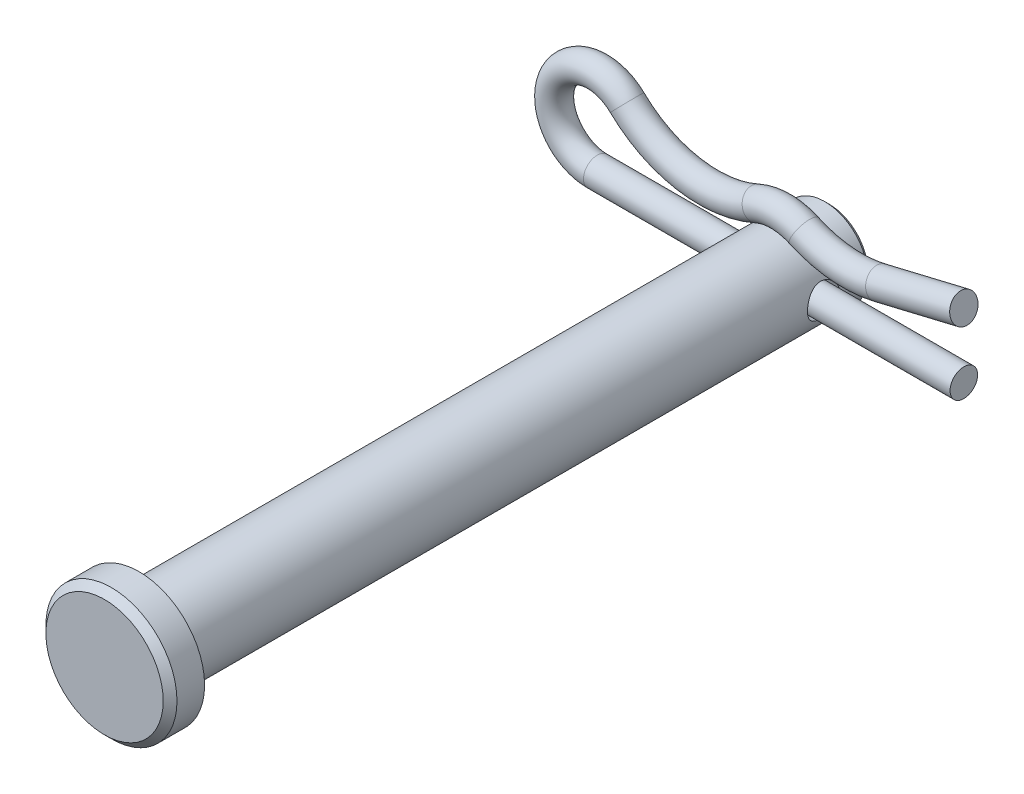
ISO-10303-21;
HEADER;
FILE_DESCRIPTION(('STEP AP214'),'2;1');
FILE_NAME('part.step','',(''),(''),'','','');
FILE_SCHEMA(('AUTOMOTIVE_DESIGN { 1 0 10303 214 1 1 1 1 }'));
ENDSEC;
DATA;
#1=APPLICATION_CONTEXT('core data for automotive mechanical design processes');
#2=APPLICATION_PROTOCOL_DEFINITION('international standard','automotive_design',2000,#1);
#3=PRODUCT_CONTEXT('',#1,'mechanical');
#4=PRODUCT('Part','Part','',(#3));
#5=PRODUCT_RELATED_PRODUCT_CATEGORY('part','',(#4));
#6=PRODUCT_DEFINITION_FORMATION('','',#4);
#7=PRODUCT_DEFINITION_CONTEXT('part definition',#1,'design');
#8=PRODUCT_DEFINITION('design','',#6,#7);
#9=PRODUCT_DEFINITION_SHAPE('','',#8);
#10=(LENGTH_UNIT() NAMED_UNIT(*) SI_UNIT(.MILLI.,.METRE.));
#11=(NAMED_UNIT(*) PLANE_ANGLE_UNIT() SI_UNIT($,.RADIAN.));
#12=(NAMED_UNIT(*) SI_UNIT($,.STERADIAN.) SOLID_ANGLE_UNIT());
#13=UNCERTAINTY_MEASURE_WITH_UNIT(LENGTH_MEASURE(1.E-05),#10,'distance_accuracy_value','');
#14=(GEOMETRIC_REPRESENTATION_CONTEXT(3) GLOBAL_UNCERTAINTY_ASSIGNED_CONTEXT((#13)) GLOBAL_UNIT_ASSIGNED_CONTEXT((#10,
#11,#12)) REPRESENTATION_CONTEXT('',''));
#15=CARTESIAN_POINT('',(0.,0.,0.));
#16=DIRECTION('',(0.,0.,1.));
#17=DIRECTION('',(1.,0.,0.));
#18=AXIS2_PLACEMENT_3D('',#15,#16,#17);
#19=CARTESIAN_POINT('',(7.30602677817418,3.28466385983467,-21.828125));
#20=DIRECTION('',(0.972644161927348,0.232300095283337,0.));
#21=DIRECTION('',(-0.232300095283337,0.972644161927348,0.));
#22=AXIS2_PLACEMENT_3D('',#19,#20,#21);
#23=CYLINDRICAL_SURFACE('',#22,1.016);
#24=CARTESIAN_POINT('',(7.30602677817418,3.28466385983467,-21.828125));
#25=DIRECTION('',(0.972644161927351,0.232300095283325,0.));
#26=DIRECTION('',(-0.232300095283325,0.972644161927351,0.));
#27=AXIS2_PLACEMENT_3D('',#24,#25,#26);
#28=CIRCLE('',#27,1.016);
#29=CARTESIAN_POINT('',(7.54204367498205,2.29645739131648,-21.828125));
#30=VERTEX_POINT('',#29);
#31=EDGE_CURVE('E46',#30,#30,#28,.T.);
#32=ORIENTED_EDGE('',*,*,#31,.T.);
#33=EDGE_LOOP('',(#32));
#34=FACE_BOUND('',#33,.T.);
#35=CARTESIAN_POINT('',(13.49375,4.76250000000001,-21.828125));
#36=DIRECTION('',(0.972644161927351,0.232300095283325,0.));
#37=DIRECTION('',(-0.232300095283325,0.972644161927351,0.));
#38=AXIS2_PLACEMENT_3D('',#35,#36,#37);
#39=CIRCLE('',#38,1.016);
#40=CARTESIAN_POINT('',(13.2577331031922,5.7507064685182,-21.828125));
#41=VERTEX_POINT('',#40);
#42=EDGE_CURVE('E11',#41,#41,#39,.T.);
#43=ORIENTED_EDGE('',*,*,#42,.F.);
#44=EDGE_LOOP('',(#43));
#45=FACE_BOUND('',#44,.T.);
#46=ADVANCED_FACE('F40',(#34,#45),#23,.T.);
#47=CARTESIAN_POINT('',(5.29632643400247,11.6993108904257,-21.828125));
#48=DIRECTION('',(0.,0.,1.));
#49=DIRECTION('',(1.,0.,0.));
#50=AXIS2_PLACEMENT_3D('',#47,#48,#49);
#51=TOROIDAL_SURFACE('',#50,8.65131089042575,1.016);
#52=CARTESIAN_POINT('',(1.72841977384718,3.8179897963947,-21.828125));
#53=DIRECTION('',(0.910997326746529,-0.412412258135811,0.));
#54=DIRECTION('',(0.412412258135811,0.910997326746529,0.));
#55=AXIS2_PLACEMENT_3D('',#52,#53,#54);
#56=CIRCLE('',#55,1.016);
#57=CARTESIAN_POINT('',(1.30940891958121,2.89241651242022,-21.828125));
#58=VERTEX_POINT('',#57);
#59=EDGE_CURVE('E50',#58,#58,#56,.T.);
#60=CARTESIAN_POINT('',(5.29632643400247,11.6993108904257,-21.828125));
#61=DIRECTION('',(0.,0.,1.));
#62=DIRECTION('',(1.,0.,0.));
#63=AXIS2_PLACEMENT_3D('',#60,#61,#62);
#64=CIRCLE('',#63,9.66731089042575);
#65=EDGE_CURVE('',#58,#30,#64,.T.);
#66=ORIENTED_EDGE('',*,*,#59,.T.);
#67=ORIENTED_EDGE('',*,*,#31,.F.);
#68=ORIENTED_EDGE('',*,*,#65,.T.);
#69=ORIENTED_EDGE('',*,*,#65,.F.);
#70=EDGE_LOOP('',(#66,#68,#67,#69));
#71=FACE_BOUND('',#70,.T.);
#72=ADVANCED_FACE('F87',(#71),#51,.T.);
#73=CARTESIAN_POINT('',(0.,0.,-21.828125));
#74=DIRECTION('',(0.,0.,-1.));
#75=DIRECTION('',(-1.,0.,0.));
#76=AXIS2_PLACEMENT_3D('',#73,#74,#75);
#77=TOROIDAL_SURFACE('',#76,4.191,1.016);
#78=CARTESIAN_POINT('',(-1.7284197738471,3.81798979639474,-21.828125));
#79=DIRECTION('',(0.910997326746538,0.412412258135789,0.));
#80=DIRECTION('',(-0.412412258135789,0.910997326746538,0.));
#81=AXIS2_PLACEMENT_3D('',#78,#79,#80);
#82=CIRCLE('',#81,1.016);
#83=CARTESIAN_POINT('',(-1.30940891958111,2.89241651242026,-21.828125));
#84=VERTEX_POINT('',#83);
#85=EDGE_CURVE('E54',#84,#84,#82,.T.);
#86=ORIENTED_EDGE('',*,*,#85,.T.);
#87=EDGE_LOOP('',(#86));
#88=FACE_BOUND('',#87,.T.);
#89=ORIENTED_EDGE('',*,*,#59,.F.);
#90=EDGE_LOOP('',(#89));
#91=FACE_BOUND('',#90,.T.);
#92=ADVANCED_FACE('F91',(#88,#91),#77,.T.);
#93=CARTESIAN_POINT('',(-5.29632643400247,11.6993108904257,-21.828125));
#94=DIRECTION('',(0.,0.,1.));
#95=DIRECTION('',(1.,0.,0.));
#96=AXIS2_PLACEMENT_3D('',#93,#94,#95);
#97=TOROIDAL_SURFACE('',#96,8.65131089042574,1.016);
#98=CARTESIAN_POINT('',(-11.2929944082361,5.46351476405987,-21.828125));
#99=DIRECTION('',(0.720792051672401,-0.693151367484686,0.));
#100=DIRECTION('',(0.693151367484686,0.720792051672401,0.));
#101=AXIS2_PLACEMENT_3D('',#98,#99,#100);
#102=CIRCLE('',#101,1.016);
#103=CARTESIAN_POINT('',(-11.9972361976005,4.7311900395607,-21.828125));
#104=VERTEX_POINT('',#103);
#105=EDGE_CURVE('E59',#104,#104,#102,.T.);
#106=CARTESIAN_POINT('',(-5.29632643400247,11.6993108904257,-21.828125));
#107=DIRECTION('',(0.,0.,1.));
#108=DIRECTION('',(1.,0.,0.));
#109=AXIS2_PLACEMENT_3D('',#106,#107,#108);
#110=CIRCLE('',#109,9.66731089042575);
#111=EDGE_CURVE('',#104,#84,#110,.T.);
#112=ORIENTED_EDGE('',*,*,#105,.T.);
#113=ORIENTED_EDGE('',*,*,#85,.F.);
#114=ORIENTED_EDGE('',*,*,#111,.T.);
#115=ORIENTED_EDGE('',*,*,#111,.F.);
#116=EDGE_LOOP('',(#112,#114,#113,#115));
#117=FACE_BOUND('',#116,.T.);
#118=ADVANCED_FACE('F97',(#117),#97,.T.);
#119=CARTESIAN_POINT('',(-13.49375,3.175,-21.828125));
#120=DIRECTION('',(0.,0.,-1.));
#121=DIRECTION('',(-1.,0.,0.));
#122=AXIS2_PLACEMENT_3D('',#119,#120,#121);
#123=TOROIDAL_SURFACE('',#122,3.175,1.016);
#124=CARTESIAN_POINT('',(-13.49375,0.,-21.828125));
#125=DIRECTION('',(-1.,0.,0.));
#126=DIRECTION('',(0.,-1.,0.));
#127=AXIS2_PLACEMENT_3D('',#124,#125,#126);
#128=CIRCLE('',#127,1.016);
#129=CARTESIAN_POINT('',(-13.49375,-1.016,-21.828125));
#130=VERTEX_POINT('',#129);
#131=EDGE_CURVE('E62',#130,#130,#128,.T.);
#132=ORIENTED_EDGE('',*,*,#131,.T.);
#133=EDGE_LOOP('',(#132));
#134=FACE_BOUND('',#133,.T.);
#135=ORIENTED_EDGE('',*,*,#105,.F.);
#136=EDGE_LOOP('',(#135));
#137=FACE_BOUND('',#136,.T.);
#138=ADVANCED_FACE('F69',(#134,#137),#123,.T.);
#139=CARTESIAN_POINT('',(-13.49375,0.,-21.828125));
#140=DIRECTION('',(1.,0.,0.));
#141=DIRECTION('',(0.,0.,-1.));
#142=AXIS2_PLACEMENT_3D('',#139,#140,#141);
#143=CYLINDRICAL_SURFACE('',#142,1.016);
#144=ORIENTED_EDGE('',*,*,#131,.F.);
#145=EDGE_LOOP('',(#144));
#146=FACE_BOUND('',#145,.T.);
#147=CARTESIAN_POINT('',(13.49375,0.,-21.828125));
#148=DIRECTION('',(-1.,0.,0.));
#149=DIRECTION('',(0.,-1.,0.));
#150=AXIS2_PLACEMENT_3D('',#147,#148,#149);
#151=CIRCLE('',#150,1.016);
#152=CARTESIAN_POINT('',(13.49375,-1.016,-21.828125));
#153=VERTEX_POINT('',#152);
#154=EDGE_CURVE('E63',#153,#153,#151,.T.);
#155=ORIENTED_EDGE('',*,*,#154,.T.);
#156=EDGE_LOOP('',(#155));
#157=FACE_BOUND('',#156,.T.);
#158=ADVANCED_FACE('F72',(#146,#157),#143,.T.);
#159=CARTESIAN_POINT('',(13.49375,4.76250000000001,-21.828125));
#160=DIRECTION('',(0.972644161927351,0.232300095283325,0.));
#161=DIRECTION('',(-0.232300095283325,0.972644161927351,0.));
#162=AXIS2_PLACEMENT_3D('',#159,#160,#161);
#163=PLANE('',#162);
#164=ORIENTED_EDGE('',*,*,#42,.T.);
#165=EDGE_LOOP('',(#164));
#166=FACE_BOUND('',#165,.T.);
#167=ADVANCED_FACE('F75',(#166),#163,.T.);
#168=CARTESIAN_POINT('',(13.49375,0.,-21.828125));
#169=DIRECTION('',(-1.,0.,0.));
#170=DIRECTION('',(0.,-1.,0.));
#171=AXIS2_PLACEMENT_3D('',#168,#169,#170);
#172=PLANE('',#171);
#173=ORIENTED_EDGE('',*,*,#154,.F.);
#174=EDGE_LOOP('',(#173));
#175=FACE_BOUND('',#174,.T.);
#176=ADVANCED_FACE('F79',(#175),#172,.F.);
#177=CLOSED_SHELL('',(#46,#72,#92,#118,#138,#158,#167,#176));
#178=MANIFOLD_SOLID_BREP('B2',#177);
#179=CARTESIAN_POINT('',(0.,0.,25.4));
#180=DIRECTION('',(0.,0.,-1.));
#181=DIRECTION('',(-1.,0.,0.));
#182=AXIS2_PLACEMENT_3D('',#179,#180,#181);
#183=CYLINDRICAL_SURFACE('',#182,3.175);
#184=CARTESIAN_POINT('',(0.,0.,-25.0825));
#185=DIRECTION('',(0.,0.,1.));
#186=DIRECTION('',(1.,0.,0.));
#187=AXIS2_PLACEMENT_3D('',#184,#185,#186);
#188=CIRCLE('',#187,3.175);
#189=CARTESIAN_POINT('',(3.175,0.,-25.0825));
#190=VERTEX_POINT('',#189);
#191=EDGE_CURVE('E163',#190,#190,#188,.T.);
#192=ORIENTED_EDGE('',*,*,#191,.T.);
#193=EDGE_LOOP('',(#192));
#194=FACE_BOUND('',#193,.T.);
#195=CARTESIAN_POINT('',(-3.175,0.,-20.6375));
#196=CARTESIAN_POINT('',(-3.1750017260582,-0.0644803280319206,-20.6374976962969));
#197=CARTESIAN_POINT('',(-3.17301863556027,-0.128944879414297,-20.6427544346972));
#198=CARTESIAN_POINT('',(-3.16530589955499,-0.255947427804686,-20.6635573799955));
#199=CARTESIAN_POINT('',(-3.15957679372107,-0.31848570096517,-20.6791021047485));
#200=CARTESIAN_POINT('',(-3.14498698210789,-0.43978574808651,-20.7198539451563));
#201=CARTESIAN_POINT('',(-3.13613231952368,-0.498554552928808,-20.7450424227273));
#202=CARTESIAN_POINT('',(-3.11617334413749,-0.611028202439702,-20.8042719653313));
#203=CARTESIAN_POINT('',(-3.10506842811866,-0.664731683597442,-20.8383154047757));
#204=CARTESIAN_POINT('',(-3.08122833533403,-0.767831218530124,-20.9157986965375));
#205=CARTESIAN_POINT('',(-3.06844702050705,-0.816983642057508,-20.9595483956684));
#206=CARTESIAN_POINT('',(-3.04292175316616,-0.907450095452757,-21.0545445325105));
#207=CARTESIAN_POINT('',(-3.03017781325932,-0.94876172610117,-21.1057932563948));
#208=CARTESIAN_POINT('',(-3.00563336052824,-1.02392323008938,-21.2167132398466));
#209=CARTESIAN_POINT('',(-2.99388727501525,-1.05742893349134,-21.2766309659458));
#210=CARTESIAN_POINT('',(-2.97338639063463,-1.11377925527679,-21.4017608811213));
#211=CARTESIAN_POINT('',(-2.96463039737106,-1.13662813187984,-21.4669709432544));
#212=CARTESIAN_POINT('',(-2.95159440179158,-1.1700544212018,-21.5980301625799));
#213=CARTESIAN_POINT('',(-2.94714552453477,-1.1810967711723,-21.6637433742581));
#214=CARTESIAN_POINT('',(-2.94273336284839,-1.19205022996995,-21.7962290754076));
#215=CARTESIAN_POINT('',(-2.94276822592073,-1.19196593587088,-21.8630011160129));
#216=CARTESIAN_POINT('',(-2.94717399857943,-1.18102403502952,-21.9914545606378));
#217=CARTESIAN_POINT('',(-2.95128528416453,-1.17081148004021,-22.0532014691726));
#218=CARTESIAN_POINT('',(-2.96294919584751,-1.14096933245487,-22.1740310506342));
#219=CARTESIAN_POINT('',(-2.97050234018473,-1.12133832170211,-22.2331133208748));
#220=CARTESIAN_POINT('',(-2.98835526113513,-1.07286225428949,-22.3482511725093));
#221=CARTESIAN_POINT('',(-2.99870429903107,-1.04384989935074,-22.4042283421088));
#222=CARTESIAN_POINT('',(-3.02096654298085,-0.977551335491413,-22.5107069292128));
#223=CARTESIAN_POINT('',(-3.03288028850369,-0.940262269910617,-22.5612064471563));
#224=CARTESIAN_POINT('',(-3.05790630844421,-0.855517884834481,-22.6588666580229));
#225=CARTESIAN_POINT('',(-3.07104532042939,-0.807547746065835,-22.7055748585938));
#226=CARTESIAN_POINT('',(-3.09635309230243,-0.704304368962598,-22.7904182606759));
#227=CARTESIAN_POINT('',(-3.10852170288599,-0.649030010276033,-22.8285521445933));
#228=CARTESIAN_POINT('',(-3.13075950879707,-0.531592978112733,-22.8956635026684));
#229=CARTESIAN_POINT('',(-3.1407933299357,-0.469337004114245,-22.9244902675942));
#230=CARTESIAN_POINT('',(-3.15736857672026,-0.340389250103887,-22.9711111921393));
#231=CARTESIAN_POINT('',(-3.1639115533356,-0.273699454858827,-22.9889102518954));
#232=CARTESIAN_POINT('',(-3.17249526812277,-0.141585349249252,-23.0121005876114));
#233=CARTESIAN_POINT('',(-3.17475686664138,-0.0762822480275023,-23.0181011938161));
#234=CARTESIAN_POINT('',(-3.17520553124475,0.0544294022336768,-23.0192985319706));
#235=CARTESIAN_POINT('',(-3.17339350069573,0.119837924680553,-23.0144976592514));
#236=CARTESIAN_POINT('',(-3.16604419632035,0.246270501045977,-22.9946914039175));
#237=CARTESIAN_POINT('',(-3.16065273826329,0.307366454105824,-22.9800852121587));
#238=CARTESIAN_POINT('',(-3.1468335994155,0.426197517997295,-22.9416085549156));
#239=CARTESIAN_POINT('',(-3.13840552373861,0.483932190588356,-22.9177368845037));
#240=CARTESIAN_POINT('',(-3.11903764373597,0.596302913556186,-22.8606457851262));
#241=CARTESIAN_POINT('',(-3.1080313141617,0.650798072574,-22.8271723024289));
#242=CARTESIAN_POINT('',(-3.08472420554452,0.753580464933009,-22.7521150056076));
#243=CARTESIAN_POINT('',(-3.07242294938803,0.801865395464671,-22.7105281972923));
#244=CARTESIAN_POINT('',(-3.04699455283473,0.893786946503481,-22.6175854780639));
#245=CARTESIAN_POINT('',(-3.03386090349835,0.936991348355826,-22.5658027674242));
#246=CARTESIAN_POINT('',(-3.00893809999065,1.01418270962823,-22.4554642133883));
#247=CARTESIAN_POINT('',(-2.99714906660554,1.04816884135274,-22.3969077624604));
#248=CARTESIAN_POINT('',(-2.9762992117158,1.10599357730704,-22.2741998104995));
#249=CARTESIAN_POINT('',(-2.96724991010742,1.12978950323491,-22.2100261079336));
#250=CARTESIAN_POINT('',(-2.95317888607235,1.16608132501843,-22.0781485000728));
#251=CARTESIAN_POINT('',(-2.94815467214383,1.17858421180018,-22.0104468062677));
#252=CARTESIAN_POINT('',(-2.94303366491605,1.1913103800891,-21.8781184233642));
#253=CARTESIAN_POINT('',(-2.94264115340402,1.19227069374821,-21.8135734735747));
#254=CARTESIAN_POINT('',(-2.94606990116576,1.18377268040514,-21.6852934052058));
#255=CARTESIAN_POINT('',(-2.94989076088501,1.17431534131035,-21.6215582104169));
#256=CARTESIAN_POINT('',(-2.96106962383437,1.14582428656504,-21.4986812637937));
#257=CARTESIAN_POINT('',(-2.96831611517726,1.12709164913741,-21.4394586876678));
#258=CARTESIAN_POINT('',(-2.98546478961414,1.08084696819061,-21.3249625026326));
#259=CARTESIAN_POINT('',(-2.99536764396202,1.0533327052505,-21.2696898963443));
#260=CARTESIAN_POINT('',(-3.01735905848772,0.988632102759095,-21.1615124856775));
#261=CARTESIAN_POINT('',(-3.02953498137515,0.951014360373895,-21.1088836800401));
#262=CARTESIAN_POINT('',(-3.05439958363509,0.86784248048113,-21.0104501359791));
#263=CARTESIAN_POINT('',(-3.06708842498621,0.822285820601665,-20.964647575013));
#264=CARTESIAN_POINT('',(-3.09237399534093,0.721582564947793,-20.8786396975664));
#265=CARTESIAN_POINT('',(-3.10492858264887,0.666050423844061,-20.8388713957112));
#266=CARTESIAN_POINT('',(-3.12780770850268,0.54865049591565,-20.7692445173742));
#267=CARTESIAN_POINT('',(-3.13813207344675,0.486782216434428,-20.7393867122343));
#268=CARTESIAN_POINT('',(-3.15574594756552,0.355599271339333,-20.6895883919429));
#269=CARTESIAN_POINT('',(-3.16288465369445,0.286078153898401,-20.6701333924722));
#270=CARTESIAN_POINT('',(-3.17250954730047,0.144363863550065,-20.644093713063));
#271=CARTESIAN_POINT('',(-3.17499806804399,0.0721720492396065,-20.6375025785069));
#272=CARTESIAN_POINT('',(-3.175,0.,-20.6375));
#273=B_SPLINE_CURVE_WITH_KNOTS('',3,(#195,#196,#197,#198,#199,#200,#201,#202,#203,#204,#205,
#206,#207,#208,#209,#210,#211,#212,#213,#214,#215,#216,#217,#218,#219,#220,#221,#222,#223,#224,
#225,#226,#227,#228,#229,#230,#231,#232,#233,#234,#235,#236,#237,#238,#239,#240,#241,#242,#243,
#244,#245,#246,#247,#248,#249,#250,#251,#252,#253,#254,#255,#256,#257,#258,#259,#260,#261,#262,
#263,#264,#265,#266,#267,#268,#269,#270,#271,#272),.UNSPECIFIED.,.T.,.F.,(4,2,2,2,2,2,2,2,2,2,2,
2,2,2,2,2,2,2,2,2,2,2,2,2,2,2,2,2,2,2,2,2,2,2,2,2,2,2,4),(0.,0.193174779988694,
0.386321736189804,0.579097274313274,0.771924557565034,0.972134347500303,1.17240530159712,
1.38030485385692,1.58812126298256,1.78741287818416,1.98662215450768,2.17390936438977,
2.36122478335592,2.55208411657195,2.74300942653255,2.94676634210301,3.15055454712146,
3.35749404133322,3.56434151635959,3.76019234336016,3.95599974284976,4.14428335102048,
4.33259145270722,4.52643257351057,4.7203453664077,4.92550862317928,5.13069029517862,
5.33672309214717,5.54262825746727,5.7353101851245,5.92797384230187,6.11475744301061,
6.30158828783601,6.4982127455814,6.69489978960167,6.90223036662893,7.109577076578,
7.32590383806683,7.54212202675676),.UNSPECIFIED.);
#274=CARTESIAN_POINT('',(-3.175,0.,-20.6375));
#275=VERTEX_POINT('',#274);
#276=EDGE_CURVE('E174',#275,#275,#273,.T.);
#277=ORIENTED_EDGE('',*,*,#276,.T.);
#278=EDGE_LOOP('',(#277));
#279=FACE_BOUND('',#278,.T.);
#280=CARTESIAN_POINT('',(3.175,0.,-23.01875));
#281=CARTESIAN_POINT('',(3.1750017260582,-0.0644803280319206,-23.0187523037031));
#282=CARTESIAN_POINT('',(3.17301863556027,-0.128944879414297,-23.0134955653029));
#283=CARTESIAN_POINT('',(3.16530589955499,-0.255947427804686,-22.9926926200045));
#284=CARTESIAN_POINT('',(3.15957679372107,-0.31848570096517,-22.9771478952515));
#285=CARTESIAN_POINT('',(3.14498698210789,-0.43978574808651,-22.9363960548437));
#286=CARTESIAN_POINT('',(3.13613231952368,-0.498554552928808,-22.9112075772727));
#287=CARTESIAN_POINT('',(3.11617334413749,-0.611028202439702,-22.8519780346687));
#288=CARTESIAN_POINT('',(3.10506842811866,-0.664731683597442,-22.8179345952243));
#289=CARTESIAN_POINT('',(3.08122833533403,-0.767831218530124,-22.7404513034625));
#290=CARTESIAN_POINT('',(3.06844702050705,-0.816983642057508,-22.6967016043316));
#291=CARTESIAN_POINT('',(3.04292175316616,-0.907450095452757,-22.6017054674895));
#292=CARTESIAN_POINT('',(3.03017781325932,-0.94876172610117,-22.5504567436052));
#293=CARTESIAN_POINT('',(3.00563336052824,-1.02392323008938,-22.4395367601535));
#294=CARTESIAN_POINT('',(2.99388727501525,-1.05742893349134,-22.3796190340543));
#295=CARTESIAN_POINT('',(2.97338639063463,-1.11377925527679,-22.2544891188787));
#296=CARTESIAN_POINT('',(2.96463039737106,-1.13662813187984,-22.1892790567456));
#297=CARTESIAN_POINT('',(2.95159440179158,-1.1700544212018,-22.0582198374201));
#298=CARTESIAN_POINT('',(2.94714552453477,-1.1810967711723,-21.9925066257419));
#299=CARTESIAN_POINT('',(2.94273336284839,-1.19205022996995,-21.8600209245924));
#300=CARTESIAN_POINT('',(2.94276822592073,-1.19196593587088,-21.7932488839871));
#301=CARTESIAN_POINT('',(2.94717399857943,-1.18102403502952,-21.6647954393622));
#302=CARTESIAN_POINT('',(2.95128528416453,-1.17081148004021,-21.6030485308274));
#303=CARTESIAN_POINT('',(2.96294919584751,-1.14096933245487,-21.4822189493658));
#304=CARTESIAN_POINT('',(2.97050234018473,-1.12133832170211,-21.4231366791252));
#305=CARTESIAN_POINT('',(2.98835526113513,-1.07286225428949,-21.3079988274907));
#306=CARTESIAN_POINT('',(2.99870429903107,-1.04384989935074,-21.2520216578912));
#307=CARTESIAN_POINT('',(3.02096654298085,-0.977551335491413,-21.1455430707872));
#308=CARTESIAN_POINT('',(3.03288028850369,-0.940262269910617,-21.0950435528437));
#309=CARTESIAN_POINT('',(3.05790630844421,-0.855517884834481,-20.9973833419771));
#310=CARTESIAN_POINT('',(3.07104532042939,-0.807547746065835,-20.9506751414062));
#311=CARTESIAN_POINT('',(3.09635309230243,-0.704304368962598,-20.8658317393242));
#312=CARTESIAN_POINT('',(3.10852170288599,-0.649030010276033,-20.8276978554068));
#313=CARTESIAN_POINT('',(3.13075950879707,-0.531592978112733,-20.7605864973316));
#314=CARTESIAN_POINT('',(3.1407933299357,-0.469337004114246,-20.7317597324058));
#315=CARTESIAN_POINT('',(3.15736857672026,-0.340389250103888,-20.6851388078607));
#316=CARTESIAN_POINT('',(3.1639115533356,-0.273699454858827,-20.6673397481046));
#317=CARTESIAN_POINT('',(3.17249526812277,-0.141585349249252,-20.6441494123886));
#318=CARTESIAN_POINT('',(3.17475686664138,-0.0762822480275023,-20.6381488061839));
#319=CARTESIAN_POINT('',(3.17520553124475,0.0544294022336768,-20.6369514680294));
#320=CARTESIAN_POINT('',(3.17339350069573,0.119837924680553,-20.6417523407486));
#321=CARTESIAN_POINT('',(3.16604419632035,0.246270501045977,-20.6615585960825));
#322=CARTESIAN_POINT('',(3.16065273826329,0.307366454105823,-20.6761647878413));
#323=CARTESIAN_POINT('',(3.1468335994155,0.426197517997294,-20.7146414450844));
#324=CARTESIAN_POINT('',(3.13840552373861,0.483932190588356,-20.7385131154963));
#325=CARTESIAN_POINT('',(3.11903764373597,0.596302913556186,-20.7956042148738));
#326=CARTESIAN_POINT('',(3.1080313141617,0.650798072574,-20.8290776975711));
#327=CARTESIAN_POINT('',(3.08472420554452,0.753580464933009,-20.9041349943924));
#328=CARTESIAN_POINT('',(3.07242294938803,0.801865395464671,-20.9457218027077));
#329=CARTESIAN_POINT('',(3.04699455283473,0.893786946503481,-21.0386645219361));
#330=CARTESIAN_POINT('',(3.03386090349835,0.936991348355826,-21.0904472325758));
#331=CARTESIAN_POINT('',(3.00893809999065,1.01418270962823,-21.2007857866117));
#332=CARTESIAN_POINT('',(2.99714906660554,1.04816884135274,-21.2593422375396));
#333=CARTESIAN_POINT('',(2.9762992117158,1.10599357730704,-21.3820501895005));
#334=CARTESIAN_POINT('',(2.96724991010742,1.12978950323491,-21.4462238920664));
#335=CARTESIAN_POINT('',(2.95317888607235,1.16608132501843,-21.5781014999272));
#336=CARTESIAN_POINT('',(2.94815467214383,1.17858421180018,-21.6458031937323));
#337=CARTESIAN_POINT('',(2.94303366491605,1.1913103800891,-21.7781315766358));
#338=CARTESIAN_POINT('',(2.94264115340402,1.19227069374821,-21.8426765264253));
#339=CARTESIAN_POINT('',(2.94606990116576,1.18377268040514,-21.9709565947942));
#340=CARTESIAN_POINT('',(2.94989076088501,1.17431534131035,-22.0346917895831));
#341=CARTESIAN_POINT('',(2.96106962383437,1.14582428656504,-22.1575687362063));
#342=CARTESIAN_POINT('',(2.96831611517726,1.12709164913741,-22.2167913123322));
#343=CARTESIAN_POINT('',(2.98546478961414,1.08084696819061,-22.3312874973674));
#344=CARTESIAN_POINT('',(2.99536764396202,1.0533327052505,-22.3865601036557));
#345=CARTESIAN_POINT('',(3.01735905848772,0.988632102759095,-22.4947375143225));
#346=CARTESIAN_POINT('',(3.02953498137515,0.951014360373895,-22.5473663199599));
#347=CARTESIAN_POINT('',(3.05439958363509,0.86784248048113,-22.6457998640209));
#348=CARTESIAN_POINT('',(3.06708842498621,0.822285820601665,-22.691602424987));
#349=CARTESIAN_POINT('',(3.09237399534093,0.721582564947793,-22.7776103024336));
#350=CARTESIAN_POINT('',(3.10492858264887,0.666050423844061,-22.8173786042888));
#351=CARTESIAN_POINT('',(3.12780770850268,0.54865049591565,-22.8870054826258));
#352=CARTESIAN_POINT('',(3.13813207344675,0.486782216434428,-22.9168632877657));
#353=CARTESIAN_POINT('',(3.15574594756552,0.355599271339333,-22.9666616080571));
#354=CARTESIAN_POINT('',(3.16288465369445,0.286078153898401,-22.9861166075278));
#355=CARTESIAN_POINT('',(3.17250954730047,0.144363863550065,-23.012156286937));
#356=CARTESIAN_POINT('',(3.17499806804399,0.0721720492396062,-23.0187474214931));
#357=CARTESIAN_POINT('',(3.175,0.,-23.01875));
#358=B_SPLINE_CURVE_WITH_KNOTS('',3,(#280,#281,#282,#283,#284,#285,#286,#287,#288,#289,#290,
#291,#292,#293,#294,#295,#296,#297,#298,#299,#300,#301,#302,#303,#304,#305,#306,#307,#308,#309,
#310,#311,#312,#313,#314,#315,#316,#317,#318,#319,#320,#321,#322,#323,#324,#325,#326,#327,#328,
#329,#330,#331,#332,#333,#334,#335,#336,#337,#338,#339,#340,#341,#342,#343,#344,#345,#346,#347,
#348,#349,#350,#351,#352,#353,#354,#355,#356,#357),.UNSPECIFIED.,.T.,.F.,(4,2,2,2,2,2,2,2,2,2,2,
2,2,2,2,2,2,2,2,2,2,2,2,2,2,2,2,2,2,2,2,2,2,2,2,2,2,2,4),(0.,0.193174779988694,
0.386321736189804,0.579097274313274,0.771924557565034,0.972134347500303,1.17240530159712,
1.38030485385692,1.58812126298256,1.78741287818416,1.98662215450768,2.17390936438977,
2.36122478335592,2.55208411657195,2.74300942653255,2.94676634210301,3.15055454712146,
3.35749404133322,3.56434151635959,3.76019234336016,3.95599974284976,4.14428335102048,
4.33259145270722,4.52643257351057,4.7203453664077,4.92550862317928,5.13069029517862,
5.33672309214719,5.54262825746727,5.7353101851245,5.92797384230187,6.11475744301061,
6.30158828783601,6.4982127455814,6.69489978960167,6.90223036662893,7.109577076578,
7.32590383806683,7.54212202675676),.UNSPECIFIED.);
#359=CARTESIAN_POINT('',(3.175,0.,-23.01875));
#360=VERTEX_POINT('',#359);
#361=EDGE_CURVE('E182',#360,#360,#358,.T.);
#362=ORIENTED_EDGE('',*,*,#361,.T.);
#363=EDGE_LOOP('',(#362));
#364=FACE_BOUND('',#363,.T.);
#365=CARTESIAN_POINT('',(0.,0.,25.4));
#366=DIRECTION('',(0.,0.,1.));
#367=DIRECTION('',(1.,0.,0.));
#368=AXIS2_PLACEMENT_3D('',#365,#366,#367);
#369=CIRCLE('',#368,3.175);
#370=CARTESIAN_POINT('',(3.175,0.,25.4));
#371=VERTEX_POINT('',#370);
#372=EDGE_CURVE('E220',#371,#371,#369,.T.);
#373=ORIENTED_EDGE('',*,*,#372,.F.);
#374=EDGE_LOOP('',(#373));
#375=FACE_BOUND('',#374,.T.);
#376=ADVANCED_FACE('F156',(#194,#279,#364,#375),#183,.T.);
#377=CARTESIAN_POINT('',(0.,0.,-25.4));
#378=DIRECTION('',(0.,0.,1.));
#379=DIRECTION('',(1.,0.,0.));
#380=AXIS2_PLACEMENT_3D('',#377,#378,#379);
#381=PLANE('',#380);
#382=CARTESIAN_POINT('',(0.,0.,-25.4));
#383=DIRECTION('',(0.,0.,1.));
#384=DIRECTION('',(1.,0.,0.));
#385=AXIS2_PLACEMENT_3D('',#382,#383,#384);
#386=CIRCLE('',#385,2.85749999999999);
#387=CARTESIAN_POINT('',(2.85749999999999,0.,-25.4));
#388=VERTEX_POINT('',#387);
#389=EDGE_CURVE('E39',#388,#388,#386,.F.);
#390=ORIENTED_EDGE('',*,*,#389,.T.);
#391=EDGE_LOOP('',(#390));
#392=FACE_BOUND('',#391,.T.);
#393=ADVANCED_FACE('F202',(#392),#381,.F.);
#394=CARTESIAN_POINT('',(0.,0.,25.4));
#395=DIRECTION('',(0.,0.,1.));
#396=DIRECTION('',(1.,0.,0.));
#397=AXIS2_PLACEMENT_3D('',#394,#395,#396);
#398=PLANE('',#397);
#399=CARTESIAN_POINT('',(0.,0.,25.4));
#400=DIRECTION('',(0.,0.,1.));
#401=DIRECTION('',(1.,0.,0.));
#402=AXIS2_PLACEMENT_3D('',#399,#400,#401);
#403=CIRCLE('',#402,4.826);
#404=CARTESIAN_POINT('',(4.826,0.,25.4));
#405=VERTEX_POINT('',#404);
#406=EDGE_CURVE('E181',#405,#405,#403,.T.);
#407=ORIENTED_EDGE('',*,*,#406,.F.);
#408=EDGE_LOOP('',(#407));
#409=FACE_BOUND('',#408,.T.);
#410=ORIENTED_EDGE('',*,*,#372,.T.);
#411=EDGE_LOOP('',(#410));
#412=FACE_BOUND('',#411,.T.);
#413=ADVANCED_FACE('F199',(#409,#412),#398,.F.);
#414=CARTESIAN_POINT('',(0.,0.,27.94));
#415=DIRECTION('',(0.,0.,-1.));
#416=DIRECTION('',(-1.,0.,0.));
#417=AXIS2_PLACEMENT_3D('',#414,#415,#416);
#418=CYLINDRICAL_SURFACE('',#417,4.826);
#419=CARTESIAN_POINT('',(0.,0.,27.432));
#420=DIRECTION('',(0.,0.,1.));
#421=DIRECTION('',(1.,0.,0.));
#422=AXIS2_PLACEMENT_3D('',#419,#420,#421);
#423=CIRCLE('',#422,4.826);
#424=CARTESIAN_POINT('',(4.826,0.,27.432));
#425=VERTEX_POINT('',#424);
#426=EDGE_CURVE('E167',#425,#425,#423,.F.);
#427=ORIENTED_EDGE('',*,*,#426,.T.);
#428=EDGE_LOOP('',(#427));
#429=FACE_BOUND('',#428,.T.);
#430=ORIENTED_EDGE('',*,*,#406,.T.);
#431=EDGE_LOOP('',(#430));
#432=FACE_BOUND('',#431,.T.);
#433=ADVANCED_FACE('F197',(#429,#432),#418,.T.);
#434=CARTESIAN_POINT('',(0.,0.,27.94));
#435=DIRECTION('',(0.,0.,1.));
#436=DIRECTION('',(1.,0.,0.));
#437=AXIS2_PLACEMENT_3D('',#434,#435,#436);
#438=PLANE('',#437);
#439=CARTESIAN_POINT('',(0.,0.,27.94));
#440=DIRECTION('',(0.,0.,1.));
#441=DIRECTION('',(1.,0.,0.));
#442=AXIS2_PLACEMENT_3D('',#439,#440,#441);
#443=CIRCLE('',#442,4.31799999999998);
#444=CARTESIAN_POINT('',(4.31799999999998,0.,27.94));
#445=VERTEX_POINT('',#444);
#446=EDGE_CURVE('E171',#445,#445,#443,.T.);
#447=ORIENTED_EDGE('',*,*,#446,.T.);
#448=EDGE_LOOP('',(#447));
#449=FACE_BOUND('',#448,.T.);
#450=ADVANCED_FACE('F193',(#449),#438,.T.);
#451=CARTESIAN_POINT('',(0.,0.,27.94));
#452=DIRECTION('',(0.,0.,-1.));
#453=DIRECTION('',(-1.,0.,0.));
#454=AXIS2_PLACEMENT_3D('',#451,#452,#453);
#455=CONICAL_SURFACE('',#454,4.31799999999998,0.785398163397451);
#456=ORIENTED_EDGE('',*,*,#426,.F.);
#457=EDGE_LOOP('',(#456));
#458=FACE_BOUND('',#457,.T.);
#459=ORIENTED_EDGE('',*,*,#446,.F.);
#460=EDGE_LOOP('',(#459));
#461=FACE_BOUND('',#460,.T.);
#462=ADVANCED_FACE('F191',(#458,#461),#455,.T.);
#463=CARTESIAN_POINT('',(-4.826,0.,-21.828125));
#464=DIRECTION('',(1.,0.,0.));
#465=DIRECTION('',(0.,0.,-1.));
#466=AXIS2_PLACEMENT_3D('',#463,#464,#465);
#467=CYLINDRICAL_SURFACE('',#466,1.190625);
#468=ORIENTED_EDGE('',*,*,#361,.F.);
#469=EDGE_LOOP('',(#468));
#470=FACE_BOUND('',#469,.T.);
#471=ORIENTED_EDGE('',*,*,#276,.F.);
#472=EDGE_LOOP('',(#471));
#473=FACE_BOUND('',#472,.T.);
#474=ADVANCED_FACE('F187',(#470,#473),#467,.F.);
#475=CARTESIAN_POINT('',(0.,0.,-25.0825));
#476=DIRECTION('',(0.,0.,1.));
#477=DIRECTION('',(1.,0.,0.));
#478=AXIS2_PLACEMENT_3D('',#475,#476,#477);
#479=CONICAL_SURFACE('',#478,3.175,0.785398163397452);
#480=ORIENTED_EDGE('',*,*,#389,.F.);
#481=EDGE_LOOP('',(#480));
#482=FACE_BOUND('',#481,.T.);
#483=ORIENTED_EDGE('',*,*,#191,.F.);
#484=EDGE_LOOP('',(#483));
#485=FACE_BOUND('',#484,.T.);
#486=ADVANCED_FACE('F158',(#482,#485),#479,.T.);
#487=CLOSED_SHELL('',(#376,#393,#413,#433,#450,#462,#474,#486));
#488=MANIFOLD_SOLID_BREP('B6_NOT_SHOWN',#487);
#489=ADVANCED_BREP_SHAPE_REPRESENTATION('',(#18,#178,#488),#14);
#490=SHAPE_DEFINITION_REPRESENTATION(#9,#489);
ENDSEC;
END-ISO-10303-21;
